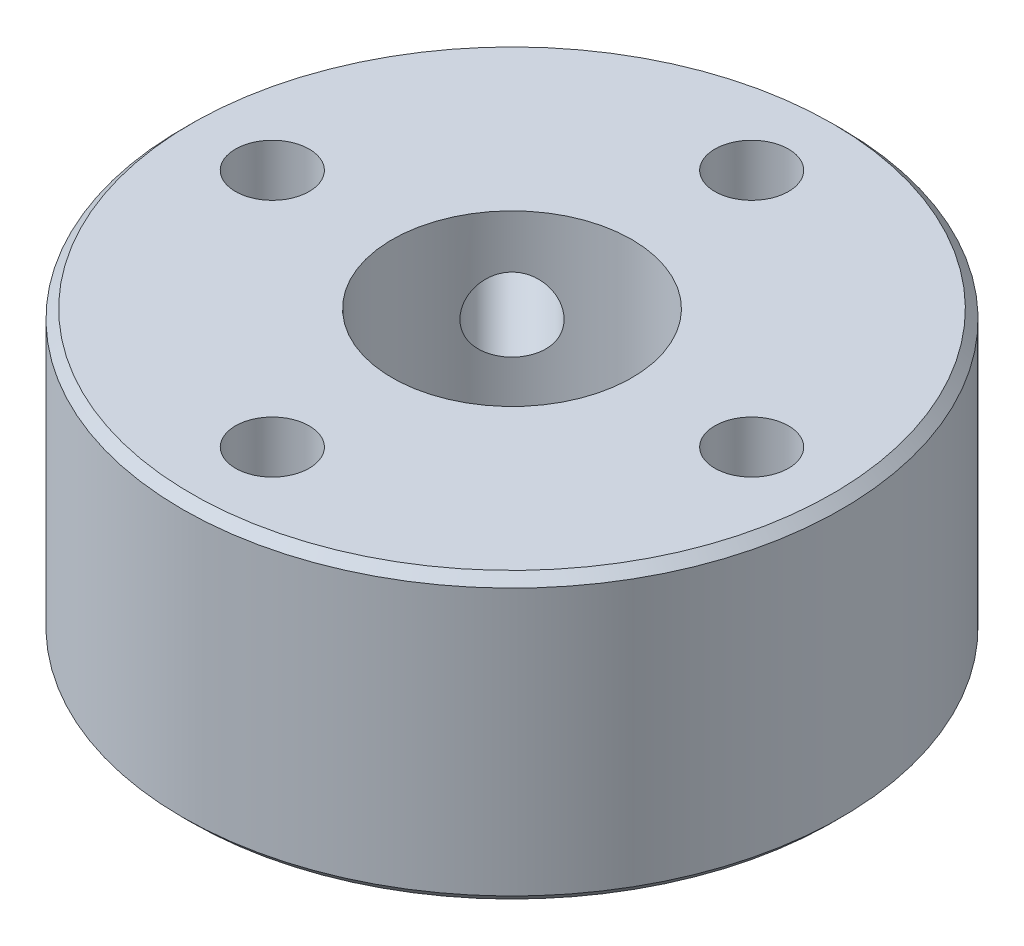
ISO-10303-21;
HEADER;
FILE_DESCRIPTION(('STEP AP214'),'2;1');
FILE_NAME('part.step','',(''),(''),'','','');
FILE_SCHEMA(('AUTOMOTIVE_DESIGN { 1 0 10303 214 1 1 1 1 }'));
ENDSEC;
DATA;
#1=APPLICATION_CONTEXT('core data for automotive mechanical design processes');
#2=APPLICATION_PROTOCOL_DEFINITION('international standard','automotive_design',2000,#1);
#3=PRODUCT_CONTEXT('',#1,'mechanical');
#4=PRODUCT('Part','Part','',(#3));
#5=PRODUCT_RELATED_PRODUCT_CATEGORY('part','',(#4));
#6=PRODUCT_DEFINITION_FORMATION('','',#4);
#7=PRODUCT_DEFINITION_CONTEXT('part definition',#1,'design');
#8=PRODUCT_DEFINITION('design','',#6,#7);
#9=PRODUCT_DEFINITION_SHAPE('','',#8);
#10=(LENGTH_UNIT() NAMED_UNIT(*) SI_UNIT(.MILLI.,.METRE.));
#11=(NAMED_UNIT(*) PLANE_ANGLE_UNIT() SI_UNIT($,.RADIAN.));
#12=(NAMED_UNIT(*) SI_UNIT($,.STERADIAN.) SOLID_ANGLE_UNIT());
#13=UNCERTAINTY_MEASURE_WITH_UNIT(LENGTH_MEASURE(1.E-05),#10,'distance_accuracy_value','');
#14=(GEOMETRIC_REPRESENTATION_CONTEXT(3) GLOBAL_UNCERTAINTY_ASSIGNED_CONTEXT((#13)) GLOBAL_UNIT_ASSIGNED_CONTEXT((#10,
#11,#12)) REPRESENTATION_CONTEXT('',''));
#15=CARTESIAN_POINT('',(0.,0.,0.));
#16=DIRECTION('',(0.,0.,1.));
#17=DIRECTION('',(1.,0.,0.));
#18=AXIS2_PLACEMENT_3D('',#15,#16,#17);
#19=CARTESIAN_POINT('',(11.,3.5,0.));
#20=DIRECTION('',(0.,-1.,0.));
#21=DIRECTION('',(0.,0.,1.));
#22=AXIS2_PLACEMENT_3D('',#19,#20,#21);
#23=PLANE('',#22);
#24=CARTESIAN_POINT('',(0.,3.5,0.));
#25=DIRECTION('',(0.,1.,0.));
#26=DIRECTION('',(0.,0.,1.));
#27=AXIS2_PLACEMENT_3D('',#24,#25,#26);
#28=CIRCLE('',#27,10.7);
#29=CARTESIAN_POINT('',(0.,3.5,10.7));
#30=VERTEX_POINT('',#29);
#31=EDGE_CURVE('E42',#30,#30,#28,.T.);
#32=ORIENTED_EDGE('',*,*,#31,.F.);
#33=EDGE_LOOP('',(#32));
#34=FACE_BOUND('',#33,.T.);
#35=CARTESIAN_POINT('',(0.,3.5,8.));
#36=DIRECTION('',(0.,1.,0.));
#37=DIRECTION('',(0.,0.,1.));
#38=AXIS2_PLACEMENT_3D('',#35,#36,#37);
#39=CIRCLE('',#38,1.22949999999999);
#40=CARTESIAN_POINT('',(0.,3.5,9.22949999999999));
#41=VERTEX_POINT('',#40);
#42=EDGE_CURVE('E143',#41,#41,#39,.T.);
#43=ORIENTED_EDGE('',*,*,#42,.T.);
#44=EDGE_LOOP('',(#43));
#45=FACE_BOUND('',#44,.T.);
#46=CARTESIAN_POINT('',(-8.,3.5,0.));
#47=DIRECTION('',(0.,1.,0.));
#48=DIRECTION('',(0.,0.,1.));
#49=AXIS2_PLACEMENT_3D('',#46,#47,#48);
#50=CIRCLE('',#49,1.22949999999999);
#51=CARTESIAN_POINT('',(-8.,3.5,1.22949999999998));
#52=VERTEX_POINT('',#51);
#53=EDGE_CURVE('E149',#52,#52,#50,.T.);
#54=ORIENTED_EDGE('',*,*,#53,.T.);
#55=EDGE_LOOP('',(#54));
#56=FACE_BOUND('',#55,.T.);
#57=CARTESIAN_POINT('',(0.,3.5,-8.));
#58=DIRECTION('',(0.,1.,0.));
#59=DIRECTION('',(0.,0.,1.));
#60=AXIS2_PLACEMENT_3D('',#57,#58,#59);
#61=CIRCLE('',#60,1.22949999999999);
#62=CARTESIAN_POINT('',(0.,3.5,-6.77050000000001));
#63=VERTEX_POINT('',#62);
#64=EDGE_CURVE('E155',#63,#63,#61,.T.);
#65=ORIENTED_EDGE('',*,*,#64,.T.);
#66=EDGE_LOOP('',(#65));
#67=FACE_BOUND('',#66,.T.);
#68=CARTESIAN_POINT('',(8.,3.5,0.));
#69=DIRECTION('',(0.,1.,0.));
#70=DIRECTION('',(0.,0.,1.));
#71=AXIS2_PLACEMENT_3D('',#68,#69,#70);
#72=CIRCLE('',#71,1.22949999999999);
#73=CARTESIAN_POINT('',(8.,3.5,1.22949999999998));
#74=VERTEX_POINT('',#73);
#75=EDGE_CURVE('E160',#74,#74,#72,.T.);
#76=ORIENTED_EDGE('',*,*,#75,.T.);
#77=EDGE_LOOP('',(#76));
#78=FACE_BOUND('',#77,.T.);
#79=CARTESIAN_POINT('',(0.,3.5,0.));
#80=DIRECTION('',(0.,1.,0.));
#81=DIRECTION('',(0.,0.,1.));
#82=AXIS2_PLACEMENT_3D('',#79,#80,#81);
#83=CIRCLE('',#82,4.75);
#84=CARTESIAN_POINT('',(0.,3.5,4.74999999999999));
#85=VERTEX_POINT('',#84);
#86=EDGE_CURVE('E68',#85,#85,#83,.T.);
#87=ORIENTED_EDGE('',*,*,#86,.T.);
#88=EDGE_LOOP('',(#87));
#89=FACE_BOUND('',#88,.T.);
#90=ADVANCED_FACE('F35',(#34,#45,#56,#67,#78,#89),#23,.T.);
#91=CARTESIAN_POINT('',(0.,3.5,0.));
#92=DIRECTION('',(0.,1.,0.));
#93=DIRECTION('',(0.,0.,-1.));
#94=AXIS2_PLACEMENT_3D('',#91,#92,#93);
#95=CYLINDRICAL_SURFACE('',#94,11.);
#96=CARTESIAN_POINT('',(0.,3.8,0.));
#97=DIRECTION('',(0.,1.,0.));
#98=DIRECTION('',(0.,0.,1.));
#99=AXIS2_PLACEMENT_3D('',#96,#97,#98);
#100=CIRCLE('',#99,11.);
#101=CARTESIAN_POINT('',(0.,3.8,11.));
#102=VERTEX_POINT('',#101);
#103=EDGE_CURVE('E46',#102,#102,#100,.F.);
#104=ORIENTED_EDGE('',*,*,#103,.F.);
#105=EDGE_LOOP('',(#104));
#106=FACE_BOUND('',#105,.T.);
#107=CARTESIAN_POINT('',(0.,12.7,0.));
#108=DIRECTION('',(0.,-1.,0.));
#109=DIRECTION('',(0.,0.,-1.));
#110=AXIS2_PLACEMENT_3D('',#107,#108,#109);
#111=CIRCLE('',#110,11.);
#112=CARTESIAN_POINT('',(0.,12.7,-11.));
#113=VERTEX_POINT('',#112);
#114=EDGE_CURVE('E50',#113,#113,#111,.F.);
#115=ORIENTED_EDGE('',*,*,#114,.F.);
#116=EDGE_LOOP('',(#115));
#117=FACE_BOUND('',#116,.T.);
#118=CARTESIAN_POINT('',(-8.59882275226415,10.,-6.86004717732644));
#119=CARTESIAN_POINT('',(-8.59882129286664,9.93117027355065,-6.8600499018174));
#120=CARTESIAN_POINT('',(-8.59518667033471,9.86229613969879,-6.86461255723123));
#121=CARTESIAN_POINT('',(-8.58070505990485,9.72646062815853,-6.88270511955675));
#122=CARTESIAN_POINT('',(-8.56985030621006,9.65950139105427,-6.89624468175966));
#123=CARTESIAN_POINT('',(-8.54113611433019,9.52948225375825,-6.93177555687223));
#124=CARTESIAN_POINT('',(-8.52328114749997,9.46641989416008,-6.95376147453005));
#125=CARTESIAN_POINT('',(-8.48090868866089,9.34593115210057,-7.00537632185254));
#126=CARTESIAN_POINT('',(-8.45639243790221,9.28850372234866,-7.035003827547));
#127=CARTESIAN_POINT('',(-8.40106000598523,9.18064350076,-7.10098913681331));
#128=CARTESIAN_POINT('',(-8.37021892433351,9.13023971994604,-7.13737348650389));
#129=CARTESIAN_POINT('',(-8.30292643558533,9.03810775599232,-7.2155434229723));
#130=CARTESIAN_POINT('',(-8.2664747621733,8.99637998489417,-7.25732926612544));
#131=CARTESIAN_POINT('',(-8.18865197844227,8.92268235973943,-7.34502684329077));
#132=CARTESIAN_POINT('',(-8.14726817514766,8.89073847238172,-7.39094914514193));
#133=CARTESIAN_POINT('',(-8.06063605791346,8.83768158482736,-7.48533534975694));
#134=CARTESIAN_POINT('',(-8.01538785998691,8.81656825961955,-7.53379917620481));
#135=CARTESIAN_POINT('',(-7.92237869391432,8.78585771157843,-7.63154280388263));
#136=CARTESIAN_POINT('',(-7.87462906785003,8.77621253169928,-7.6808183272306));
#137=CARTESIAN_POINT('',(-7.77774587505639,8.76856357150504,-7.77890866410947));
#138=CARTESIAN_POINT('',(-7.72861235250449,8.77055941999728,-7.82772349228065));
#139=CARTESIAN_POINT('',(-7.63060282385128,8.78609715402838,-7.92329264140649));
#140=CARTESIAN_POINT('',(-7.58172664713829,8.79958746827753,-7.97005518631401));
#141=CARTESIAN_POINT('',(-7.48548004971541,8.83765072971335,-8.06051817694851));
#142=CARTESIAN_POINT('',(-7.43810965268493,8.86222385109248,-8.10421857453416));
#143=CARTESIAN_POINT('',(-7.3462524680981,8.92181097404819,-8.18757803353648));
#144=CARTESIAN_POINT('',(-7.30177217789715,8.95684757301967,-8.22722809638135));
#145=CARTESIAN_POINT('',(-7.21724446292287,9.03635067096609,-8.30147892461426));
#146=CARTESIAN_POINT('',(-7.17719720081485,9.08081751579956,-8.33607950473163));
#147=CARTESIAN_POINT('',(-7.10266882414202,9.17820836854335,-8.39967343441055));
#148=CARTESIAN_POINT('',(-7.06821933196113,9.23117727652084,-8.42863509976386));
#149=CARTESIAN_POINT('',(-7.00635601568624,9.34391362832917,-8.48012975127206));
#150=CARTESIAN_POINT('',(-6.97894220644453,9.40368108651133,-8.50266272385603));
#151=CARTESIAN_POINT('',(-6.93213466591203,9.52835479035665,-8.54086802109923));
#152=CARTESIAN_POINT('',(-6.91274331916311,9.59326255706963,-8.55653830602106));
#153=CARTESIAN_POINT('',(-6.88271886669935,9.72635573816775,-8.58070835399781));
#154=CARTESIAN_POINT('',(-6.87208542582928,9.79454102702009,-8.58920839145036));
#155=CARTESIAN_POINT('',(-6.86001578135319,9.93185968774098,-8.59885131363562));
#156=CARTESIAN_POINT('',(-6.85853024334924,10.0009859555007,-8.60003366264347));
#157=CARTESIAN_POINT('',(-6.86468155524226,10.1385699773895,-8.59512431686715));
#158=CARTESIAN_POINT('',(-6.8723182504751,10.2070277428329,-8.58903274540964));
#159=CARTESIAN_POINT('',(-6.8963903859812,10.3411461960801,-8.56971611635838));
#160=CARTESIAN_POINT('',(-6.9128023906119,10.4068138333851,-8.55651005825033));
#161=CARTESIAN_POINT('',(-6.95380062021488,10.5337046001684,-8.52322415941052));
#162=CARTESIAN_POINT('',(-6.97838707725326,10.594927603407,-8.50314412353161));
#163=CARTESIAN_POINT('',(-7.03496857701433,10.711476469011,-8.45639193404135));
#164=CARTESIAN_POINT('',(-7.0669945967379,10.7667762209719,-8.42969218495235));
#165=CARTESIAN_POINT('',(-7.13727450203434,10.8696433254806,-8.37027029633066));
#166=CARTESIAN_POINT('',(-7.17552858060803,10.9172104383108,-8.33754797016072));
#167=CARTESIAN_POINT('',(-7.25715381142176,11.0034803333431,-8.26659846919221));
#168=CARTESIAN_POINT('',(-7.30054733997073,11.0421420210789,-8.22834704969394));
#169=CARTESIAN_POINT('',(-7.39087488219221,11.1092201293992,-8.14730906210454));
#170=CARTESIAN_POINT('',(-7.43780883699376,11.1376367202959,-8.10452256941878));
#171=CARTESIAN_POINT('',(-7.53360671484874,11.1833491434294,-8.0155492793842));
#172=CARTESIAN_POINT('',(-7.58246616180406,11.2006693192775,-7.96937017484399));
#173=CARTESIAN_POINT('',(-7.68070326147241,11.2237765974083,-7.87473469595186));
#174=CARTESIAN_POINT('',(-7.73008089566469,11.2295641104828,-7.82627840277602));
#175=CARTESIAN_POINT('',(-7.82762916245487,11.2294351646831,-7.72870979661974));
#176=CARTESIAN_POINT('',(-7.87580490581898,11.2235823074418,-7.67960249688663));
#177=CARTESIAN_POINT('',(-7.96989611416686,11.2004727246223,-7.58190985233426));
#178=CARTESIAN_POINT('',(-8.01581157870994,11.1832159968206,-7.53332450761676));
#179=CARTESIAN_POINT('',(-8.10418756106389,11.1378072227246,-7.43816933008204));
#180=CARTESIAN_POINT('',(-8.14664883688748,11.1096575747014,-7.39159905611854));
#181=CARTESIAN_POINT('',(-8.22711463283213,11.0432686601022,-7.30193250847853));
#182=CARTESIAN_POINT('',(-8.26511914355333,11.0050293722464,-7.2588362421292));
#183=CARTESIAN_POINT('',(-8.33601872521167,10.9193093469204,-7.17730664980136));
#184=CARTESIAN_POINT('',(-8.36888596969905,10.8717812190087,-7.13889894974694));
#185=CARTESIAN_POINT('',(-8.42859185980105,10.7689290627491,-7.0683083258122));
#186=CARTESIAN_POINT('',(-8.4554290659993,10.7136031781349,-7.03612688844268));
#187=CARTESIAN_POINT('',(-8.50260660126548,10.5965325750513,-6.97904440373246));
#188=CARTESIAN_POINT('',(-8.52292643825367,10.534768404314,-6.9541663402228));
#189=CARTESIAN_POINT('',(-8.55654499322926,10.4067511857121,-6.9127603432825));
#190=CARTESIAN_POINT('',(-8.56985150583789,10.340503213986,-6.89622314068824));
#191=CARTESIAN_POINT('',(-8.58594789644361,10.2282449508027,-6.87616155699825));
#192=CARTESIAN_POINT('',(-8.59077130839622,10.1829483447688,-6.87012920246373));
#193=CARTESIAN_POINT('',(-8.59720921390327,10.091774405567,-6.86207111546855));
#194=CARTESIAN_POINT('',(-8.59882372542038,10.0458970756512,-6.8600453605799));
#195=CARTESIAN_POINT('',(-8.59882275226415,10.,-6.86004717732644));
#196=B_SPLINE_CURVE_WITH_KNOTS('',3,(#118,#119,#120,#121,#122,#123,#124,#125,#126,#127,#128,
#129,#130,#131,#132,#133,#134,#135,#136,#137,#138,#139,#140,#141,#142,#143,#144,#145,#146,#147,
#148,#149,#150,#151,#152,#153,#154,#155,#156,#157,#158,#159,#160,#161,#162,#163,#164,#165,#166,
#167,#168,#169,#170,#171,#172,#173,#174,#175,#176,#177,#178,#179,#180,#181,#182,#183,#184,#185,
#186,#187,#188,#189,#190,#191,#192,#193,#194,#195),.UNSPECIFIED.,.T.,.F.,(4,2,2,2,2,2,2,2,2,2,2,
2,2,2,2,2,2,2,2,2,2,2,2,2,2,2,2,2,2,2,2,2,2,2,2,2,2,2,4),(0.,0.206321545013445,
0.412865364062192,0.619277468546969,0.825651136963587,1.03285344571688,1.24006559268876,
1.44782301394025,1.65557420029521,1.86245353056594,2.06932626419705,2.27527569668961,
2.48122836627608,2.68762907712022,2.89403735911312,3.10157391426357,3.30911090751898,
3.51670954340796,3.72430023436097,3.93077040670091,4.13723707846407,4.34315508735514,
4.54907894259134,4.75587610382279,4.96267967469486,5.17041924095308,5.3781553536347,
5.58543415443761,5.79270557186788,5.99884759351556,6.20498965535492,6.41108635713309,
6.61718349358666,6.82436093349382,7.03158777582831,7.23945994009084,7.44710058507751,
7.58468080015715,7.72226024509264),.UNSPECIFIED.);
#197=CARTESIAN_POINT('',(-8.59882275226415,10.,-6.86004717732644));
#198=VERTEX_POINT('',#197);
#199=EDGE_CURVE('E123',#198,#198,#196,.T.);
#200=ORIENTED_EDGE('',*,*,#199,.T.);
#201=EDGE_LOOP('',(#200));
#202=FACE_BOUND('',#201,.T.);
#203=ADVANCED_FACE('F112',(#106,#117,#202),#95,.T.);
#204=CARTESIAN_POINT('',(0.,13.,0.));
#205=DIRECTION('',(0.,1.,0.));
#206=DIRECTION('',(0.,0.,-1.));
#207=AXIS2_PLACEMENT_3D('',#204,#205,#206);
#208=PLANE('',#207);
#209=CARTESIAN_POINT('',(0.,13.,0.));
#210=DIRECTION('',(0.,-1.,0.));
#211=DIRECTION('',(0.,0.,-1.));
#212=AXIS2_PLACEMENT_3D('',#209,#210,#211);
#213=CIRCLE('',#212,10.7);
#214=CARTESIAN_POINT('',(0.,13.,-10.7));
#215=VERTEX_POINT('',#214);
#216=EDGE_CURVE('E10',#215,#215,#213,.T.);
#217=ORIENTED_EDGE('',*,*,#216,.F.);
#218=EDGE_LOOP('',(#217));
#219=FACE_BOUND('',#218,.T.);
#220=CARTESIAN_POINT('',(0.,13.,0.));
#221=DIRECTION('',(0.,-1.,0.));
#222=DIRECTION('',(0.,0.,-1.));
#223=AXIS2_PLACEMENT_3D('',#220,#221,#222);
#224=CIRCLE('',#223,3.99999999999999);
#225=CARTESIAN_POINT('',(0.,13.,-4.));
#226=VERTEX_POINT('',#225);
#227=EDGE_CURVE('E128',#226,#226,#224,.T.);
#228=ORIENTED_EDGE('',*,*,#227,.T.);
#229=EDGE_LOOP('',(#228));
#230=FACE_BOUND('',#229,.T.);
#231=CARTESIAN_POINT('',(0.,13.,8.));
#232=DIRECTION('',(0.,-1.,0.));
#233=DIRECTION('',(0.,0.,-1.));
#234=AXIS2_PLACEMENT_3D('',#231,#232,#233);
#235=CIRCLE('',#234,1.22949999999999);
#236=CARTESIAN_POINT('',(0.,13.,6.77050000000001));
#237=VERTEX_POINT('',#236);
#238=EDGE_CURVE('E140',#237,#237,#235,.T.);
#239=ORIENTED_EDGE('',*,*,#238,.T.);
#240=EDGE_LOOP('',(#239));
#241=FACE_BOUND('',#240,.T.);
#242=CARTESIAN_POINT('',(-8.,13.,0.));
#243=DIRECTION('',(0.,-1.,0.));
#244=DIRECTION('',(0.,0.,-1.));
#245=AXIS2_PLACEMENT_3D('',#242,#243,#244);
#246=CIRCLE('',#245,1.22949999999999);
#247=CARTESIAN_POINT('',(-8.,13.,-1.22949999999999));
#248=VERTEX_POINT('',#247);
#249=EDGE_CURVE('E146',#248,#248,#246,.T.);
#250=ORIENTED_EDGE('',*,*,#249,.T.);
#251=EDGE_LOOP('',(#250));
#252=FACE_BOUND('',#251,.T.);
#253=CARTESIAN_POINT('',(0.,13.,-8.));
#254=DIRECTION('',(0.,-1.,0.));
#255=DIRECTION('',(0.,0.,-1.));
#256=AXIS2_PLACEMENT_3D('',#253,#254,#255);
#257=CIRCLE('',#256,1.22949999999999);
#258=CARTESIAN_POINT('',(0.,13.,-9.22949999999999));
#259=VERTEX_POINT('',#258);
#260=EDGE_CURVE('E152',#259,#259,#257,.T.);
#261=ORIENTED_EDGE('',*,*,#260,.T.);
#262=EDGE_LOOP('',(#261));
#263=FACE_BOUND('',#262,.T.);
#264=CARTESIAN_POINT('',(8.,13.,0.));
#265=DIRECTION('',(0.,-1.,0.));
#266=DIRECTION('',(0.,0.,-1.));
#267=AXIS2_PLACEMENT_3D('',#264,#265,#266);
#268=CIRCLE('',#267,1.22949999999999);
#269=CARTESIAN_POINT('',(8.,13.,-1.22949999999999));
#270=VERTEX_POINT('',#269);
#271=EDGE_CURVE('E158',#270,#270,#268,.T.);
#272=ORIENTED_EDGE('',*,*,#271,.T.);
#273=EDGE_LOOP('',(#272));
#274=FACE_BOUND('',#273,.T.);
#275=ADVANCED_FACE('F108',(#219,#230,#241,#252,#263,#274),#208,.T.);
#276=CARTESIAN_POINT('',(0.,0.,0.));
#277=DIRECTION('',(0.,1.,0.));
#278=DIRECTION('',(0.,0.,-1.));
#279=AXIS2_PLACEMENT_3D('',#276,#277,#278);
#280=CYLINDRICAL_SURFACE('',#279,4.75);
#281=CARTESIAN_POINT('',(0.,0.299999999999999,0.));
#282=DIRECTION('',(0.,1.,0.));
#283=DIRECTION('',(0.,0.,1.));
#284=AXIS2_PLACEMENT_3D('',#281,#282,#283);
#285=CIRCLE('',#284,4.75);
#286=CARTESIAN_POINT('',(0.,0.299999999999999,4.74999999999999));
#287=VERTEX_POINT('',#286);
#288=EDGE_CURVE('E55',#287,#287,#285,.F.);
#289=ORIENTED_EDGE('',*,*,#288,.F.);
#290=EDGE_LOOP('',(#289));
#291=FACE_BOUND('',#290,.T.);
#292=ORIENTED_EDGE('',*,*,#86,.F.);
#293=EDGE_LOOP('',(#292));
#294=FACE_BOUND('',#293,.T.);
#295=ADVANCED_FACE('F104',(#291,#294),#280,.T.);
#296=CARTESIAN_POINT('',(0.,0.,0.));
#297=DIRECTION('',(0.,-1.,0.));
#298=DIRECTION('',(0.,0.,1.));
#299=AXIS2_PLACEMENT_3D('',#296,#297,#298);
#300=PLANE('',#299);
#301=CARTESIAN_POINT('',(0.,0.,0.));
#302=DIRECTION('',(0.,1.,0.));
#303=DIRECTION('',(0.,0.,1.));
#304=AXIS2_PLACEMENT_3D('',#301,#302,#303);
#305=CIRCLE('',#304,4.45);
#306=CARTESIAN_POINT('',(0.,0.,4.44999999999999));
#307=VERTEX_POINT('',#306);
#308=EDGE_CURVE('E58',#307,#307,#305,.T.);
#309=ORIENTED_EDGE('',*,*,#308,.F.);
#310=EDGE_LOOP('',(#309));
#311=FACE_BOUND('',#310,.T.);
#312=CARTESIAN_POINT('',(0.,0.,0.));
#313=DIRECTION('',(0.,-1.,0.));
#314=DIRECTION('',(0.,0.,-1.));
#315=AXIS2_PLACEMENT_3D('',#312,#313,#314);
#316=CIRCLE('',#315,2.00000000000001);
#317=CARTESIAN_POINT('',(0.,0.,-2.00000000000002));
#318=VERTEX_POINT('',#317);
#319=EDGE_CURVE('E137',#318,#318,#316,.T.);
#320=ORIENTED_EDGE('',*,*,#319,.F.);
#321=EDGE_LOOP('',(#320));
#322=FACE_BOUND('',#321,.T.);
#323=ADVANCED_FACE('F100',(#311,#322),#300,.T.);
#324=CARTESIAN_POINT('',(8.,13.,0.));
#325=DIRECTION('',(0.,1.,0.));
#326=DIRECTION('',(0.,0.,-1.));
#327=AXIS2_PLACEMENT_3D('',#324,#325,#326);
#328=CYLINDRICAL_SURFACE('',#327,1.22949999999999);
#329=ORIENTED_EDGE('',*,*,#75,.F.);
#330=EDGE_LOOP('',(#329));
#331=FACE_BOUND('',#330,.T.);
#332=ORIENTED_EDGE('',*,*,#271,.F.);
#333=EDGE_LOOP('',(#332));
#334=FACE_BOUND('',#333,.T.);
#335=ADVANCED_FACE('F96',(#331,#334),#328,.F.);
#336=CARTESIAN_POINT('',(0.,13.,-8.));
#337=DIRECTION('',(0.,1.,0.));
#338=DIRECTION('',(0.,0.,-1.));
#339=AXIS2_PLACEMENT_3D('',#336,#337,#338);
#340=CYLINDRICAL_SURFACE('',#339,1.22949999999999);
#341=ORIENTED_EDGE('',*,*,#64,.F.);
#342=EDGE_LOOP('',(#341));
#343=FACE_BOUND('',#342,.T.);
#344=ORIENTED_EDGE('',*,*,#260,.F.);
#345=EDGE_LOOP('',(#344));
#346=FACE_BOUND('',#345,.T.);
#347=ADVANCED_FACE('F92',(#343,#346),#340,.F.);
#348=CARTESIAN_POINT('',(-8.,13.,0.));
#349=DIRECTION('',(0.,1.,0.));
#350=DIRECTION('',(0.,0.,-1.));
#351=AXIS2_PLACEMENT_3D('',#348,#349,#350);
#352=CYLINDRICAL_SURFACE('',#351,1.22949999999999);
#353=ORIENTED_EDGE('',*,*,#53,.F.);
#354=EDGE_LOOP('',(#353));
#355=FACE_BOUND('',#354,.T.);
#356=ORIENTED_EDGE('',*,*,#249,.F.);
#357=EDGE_LOOP('',(#356));
#358=FACE_BOUND('',#357,.T.);
#359=ADVANCED_FACE('F88',(#355,#358),#352,.F.);
#360=CARTESIAN_POINT('',(0.,13.,8.));
#361=DIRECTION('',(0.,1.,0.));
#362=DIRECTION('',(0.,0.,-1.));
#363=AXIS2_PLACEMENT_3D('',#360,#361,#362);
#364=CYLINDRICAL_SURFACE('',#363,1.22949999999999);
#365=ORIENTED_EDGE('',*,*,#42,.F.);
#366=EDGE_LOOP('',(#365));
#367=FACE_BOUND('',#366,.T.);
#368=ORIENTED_EDGE('',*,*,#238,.F.);
#369=EDGE_LOOP('',(#368));
#370=FACE_BOUND('',#369,.T.);
#371=ADVANCED_FACE('F84',(#367,#370),#364,.F.);
#372=CARTESIAN_POINT('',(0.,13.,0.));
#373=DIRECTION('',(0.,1.,0.));
#374=DIRECTION('',(0.,0.,-1.));
#375=AXIS2_PLACEMENT_3D('',#372,#373,#374);
#376=CYLINDRICAL_SURFACE('',#375,2.00000000000001);
#377=ORIENTED_EDGE('',*,*,#319,.T.);
#378=EDGE_LOOP('',(#377));
#379=FACE_BOUND('',#378,.T.);
#380=CARTESIAN_POINT('',(0.,4.5,0.));
#381=DIRECTION('',(0.,-1.,0.));
#382=DIRECTION('',(0.,0.,-1.));
#383=AXIS2_PLACEMENT_3D('',#380,#381,#382);
#384=CIRCLE('',#383,2.00000000000001);
#385=CARTESIAN_POINT('',(0.,4.5,-2.00000000000002));
#386=VERTEX_POINT('',#385);
#387=EDGE_CURVE('E134',#386,#386,#384,.T.);
#388=ORIENTED_EDGE('',*,*,#387,.F.);
#389=EDGE_LOOP('',(#388));
#390=FACE_BOUND('',#389,.T.);
#391=ADVANCED_FACE('F80',(#379,#390),#376,.F.);
#392=CARTESIAN_POINT('',(2.00000000000001,4.5,0.));
#393=DIRECTION('',(0.,-1.,0.));
#394=DIRECTION('',(0.,0.,1.));
#395=AXIS2_PLACEMENT_3D('',#392,#393,#394);
#396=PLANE('',#395);
#397=ORIENTED_EDGE('',*,*,#387,.T.);
#398=EDGE_LOOP('',(#397));
#399=FACE_BOUND('',#398,.T.);
#400=CARTESIAN_POINT('',(0.,4.5,0.));
#401=DIRECTION('',(0.,-1.,0.));
#402=DIRECTION('',(0.,0.,-1.));
#403=AXIS2_PLACEMENT_3D('',#400,#401,#402);
#404=CIRCLE('',#403,3.99999999999999);
#405=CARTESIAN_POINT('',(0.,4.5,-4.));
#406=VERTEX_POINT('',#405);
#407=EDGE_CURVE('E131',#406,#406,#404,.T.);
#408=ORIENTED_EDGE('',*,*,#407,.F.);
#409=EDGE_LOOP('',(#408));
#410=FACE_BOUND('',#409,.T.);
#411=ADVANCED_FACE('F76',(#399,#410),#396,.F.);
#412=CARTESIAN_POINT('',(0.,13.,0.));
#413=DIRECTION('',(0.,1.,0.));
#414=DIRECTION('',(0.,0.,-1.));
#415=AXIS2_PLACEMENT_3D('',#412,#413,#414);
#416=CYLINDRICAL_SURFACE('',#415,3.99999999999999);
#417=CARTESIAN_POINT('',(-3.56088641741461,10.,-1.82211084247697));
#418=CARTESIAN_POINT('',(-3.56088636044018,9.93271323239236,-1.82211166057228));
#419=CARTESIAN_POINT('',(-3.55824279191973,9.86542031464729,-1.82730530468804));
#420=CARTESIAN_POINT('',(-3.54765563516587,9.73280747245185,-1.84777395183811));
#421=CARTESIAN_POINT('',(-3.53971047582309,9.66748813886653,-1.86305194332177));
#422=CARTESIAN_POINT('',(-3.51850120608781,9.54076205874594,-1.90280093089096));
#423=CARTESIAN_POINT('',(-3.50524627054824,9.47934877390323,-1.92725606505075));
#424=CARTESIAN_POINT('',(-3.47335860076753,9.36185116370561,-1.98414701435012));
#425=CARTESIAN_POINT('',(-3.45472497570161,9.30576772313258,-2.01658415134688));
#426=CARTESIAN_POINT('',(-3.41137574632521,9.19865819722333,-2.08910241543031));
#427=CARTESIAN_POINT('',(-3.38649385425278,9.147835324643,-2.12938435577803));
#428=CARTESIAN_POINT('',(-3.33095125416187,9.05450275612301,-2.21525961290904));
#429=CARTESIAN_POINT('',(-3.30028976733767,9.01199418211756,-2.26085364518504));
#430=CARTESIAN_POINT('',(-3.23259764283245,8.93560607734146,-2.35665471377096));
#431=CARTESIAN_POINT('',(-3.19544268081067,8.90193496235179,-2.40694067071496));
#432=CARTESIAN_POINT('',(-3.11569403434941,8.84554820014902,-2.50931332668817));
#433=CARTESIAN_POINT('',(-3.0731015871935,8.82283006621762,-2.56139961409735));
#434=CARTESIAN_POINT('',(-2.98466876958245,8.78967016798867,-2.66386809179658));
#435=CARTESIAN_POINT('',(-2.93896379284495,8.77888126864208,-2.71425461952537));
#436=CARTESIAN_POINT('',(-2.84440930331211,8.76878714934073,-2.81318562279717));
#437=CARTESIAN_POINT('',(-2.79556048513687,8.76947940128593,-2.86173050150376));
#438=CARTESIAN_POINT('',(-2.69789199908769,8.78209764755673,-2.95393667265013));
#439=CARTESIAN_POINT('',(-2.64912589934441,8.79364749538074,-2.99770694646493));
#440=CARTESIAN_POINT('',(-2.5516088828605,8.82703702811001,-3.08113815157546));
#441=CARTESIAN_POINT('',(-2.50285796730161,8.84887737645401,-3.12079881771956));
#442=CARTESIAN_POINT('',(-2.40640504246629,8.90247499172924,-3.19577757446895));
#443=CARTESIAN_POINT('',(-2.35872264121792,8.93434812099455,-3.23103784059611));
#444=CARTESIAN_POINT('',(-2.26665411695412,9.00701413463461,-3.29628089283317));
#445=CARTESIAN_POINT('',(-2.22226881009435,9.04780921773894,-3.32626237474419));
#446=CARTESIAN_POINT('',(-2.13668846579986,9.13910047339346,-3.38190397522514));
#447=CARTESIAN_POINT('',(-2.09569463446282,9.18992186795826,-3.40734070025252));
#448=CARTESIAN_POINT('',(-2.0207064340188,9.2988253917779,-3.45234167175166));
#449=CARTESIAN_POINT('',(-1.98671283455157,9.35690831827407,-3.47190527261155));
#450=CARTESIAN_POINT('',(-1.92701109845606,9.47951041315459,-3.50539830494747));
#451=CARTESIAN_POINT('',(-1.90139376378875,9.54409079136133,-3.51926638259997));
#452=CARTESIAN_POINT('',(-1.86035872257254,9.67735267159558,-3.54113149887052));
#453=CARTESIAN_POINT('',(-1.84493749231934,9.74603274783954,-3.54913056588367));
#454=CARTESIAN_POINT('',(-1.82561672038283,9.88267579503358,-3.55910633887849));
#455=CARTESIAN_POINT('',(-1.82129153028986,9.95056237935887,-3.56130562388302));
#456=CARTESIAN_POINT('',(-1.82318645087371,10.086143202587,-3.56033605796613));
#457=CARTESIAN_POINT('',(-1.82940499648719,10.1538374685427,-3.55716800374775));
#458=CARTESIAN_POINT('',(-1.85169305994496,10.2851643256409,-3.54561437294675));
#459=CARTESIAN_POINT('',(-1.86748510050071,10.3488574789518,-3.53737566470496));
#460=CARTESIAN_POINT('',(-1.90783716400721,10.4724827344969,-3.51577553199073));
#461=CARTESIAN_POINT('',(-1.93239858586756,10.53241423487,-3.50241329017662));
#462=CARTESIAN_POINT('',(-1.98991926897622,10.6486664712185,-3.4700628295757));
#463=CARTESIAN_POINT('',(-2.02309388570291,10.7048396427184,-3.4509279260636));
#464=CARTESIAN_POINT('',(-2.0960225432001,10.8103489424882,-3.4071242641586));
#465=CARTESIAN_POINT('',(-2.13577823732119,10.8596833469315,-3.38245411460225));
#466=CARTESIAN_POINT('',(-2.22199843231044,10.9521442502638,-3.32647919373079));
#467=CARTESIAN_POINT('',(-2.26866731976413,10.9949445224406,-3.29494898054064));
#468=CARTESIAN_POINT('',(-2.36559326149792,11.0706694310964,-3.22606542413734));
#469=CARTESIAN_POINT('',(-2.41585014491811,11.1035945374417,-3.18871235810759));
#470=CARTESIAN_POINT('',(-2.51766488602866,11.158317372035,-3.10894035881918));
#471=CARTESIAN_POINT('',(-2.5692101220145,11.1801968972725,-3.06656162317438));
#472=CARTESIAN_POINT('',(-2.67206292344338,11.2124071440254,-2.97736564871453));
#473=CARTESIAN_POINT('',(-2.72337055594718,11.2227413504674,-2.93054975387654));
#474=CARTESIAN_POINT('',(-2.82193039803925,11.2312919563112,-2.83570076161695));
#475=CARTESIAN_POINT('',(-2.86926270993315,11.2299803366133,-2.78779293514954));
#476=CARTESIAN_POINT('',(-2.96070314443789,11.2164124791111,-2.69048217085116));
#477=CARTESIAN_POINT('',(-3.0048114655498,11.2041569157404,-2.64107932533375));
#478=CARTESIAN_POINT('',(-3.08826701267712,11.1693461925415,-2.54297267364229));
#479=CARTESIAN_POINT('',(-3.12766412535923,11.1469138402577,-2.49426747859603));
#480=CARTESIAN_POINT('',(-3.20164316502022,11.0924967521972,-2.3985710866993));
#481=CARTESIAN_POINT('',(-3.23622427819202,11.0605104048521,-2.35158018051691));
#482=CARTESIAN_POINT('',(-3.30127706387479,10.9866660981631,-2.25939366080646));
#483=CARTESIAN_POINT('',(-3.33157458054523,10.9445161350955,-2.21430914377304));
#484=CARTESIAN_POINT('',(-3.38651586865366,10.8520605595793,-2.12933687304591));
#485=CARTESIAN_POINT('',(-3.41115796971961,10.8017525450536,-2.08945065621086));
#486=CARTESIAN_POINT('',(-3.45548075500827,10.6924939317204,-2.01533614548439));
#487=CARTESIAN_POINT('',(-3.47497913151384,10.6333196929467,-1.98132762559641));
#488=CARTESIAN_POINT('',(-3.50801460339819,10.5091478000506,-1.92223465813026));
#489=CARTESIAN_POINT('',(-3.52155430096675,10.4441527028851,-1.8971463159799));
#490=CARTESIAN_POINT('',(-3.54174435321202,10.3165159659032,-1.85915725330068));
#491=CARTESIAN_POINT('',(-3.54892539249878,10.2542336202343,-1.84532789411869));
#492=CARTESIAN_POINT('',(-3.55849590908534,10.1279691114302,-1.82680533430844));
#493=CARTESIAN_POINT('',(-3.56088647159528,10.0639873366035,-1.82211006449726));
#494=CARTESIAN_POINT('',(-3.56088641741461,10.,-1.82211084247697));
#495=B_SPLINE_CURVE_WITH_KNOTS('',3,(#417,#418,#419,#420,#421,#422,#423,#424,#425,#426,#427,
#428,#429,#430,#431,#432,#433,#434,#435,#436,#437,#438,#439,#440,#441,#442,#443,#444,#445,#446,
#447,#448,#449,#450,#451,#452,#453,#454,#455,#456,#457,#458,#459,#460,#461,#462,#463,#464,#465,
#466,#467,#468,#469,#470,#471,#472,#473,#474,#475,#476,#477,#478,#479,#480,#481,#482,#483,#484,
#485,#486,#487,#488,#489,#490,#491,#492,#493,#494),.UNSPECIFIED.,.T.,.F.,(4,2,2,2,2,2,2,2,2,2,2,
2,2,2,2,2,2,2,2,2,2,2,2,2,2,2,2,2,2,2,2,2,2,2,2,2,2,2,4),(0.,0.201624072764263,
0.403307922725165,0.604644772641534,0.806014987351853,1.01345060448725,1.22091419377153,
1.43290248547724,1.64484262557059,1.85043834262084,2.05598878898113,2.25467080257228,
2.45336562714238,2.65444488101846,2.85557374489114,3.06482451305133,3.27409827499637,
3.48557073241775,3.69697006814365,3.90012978234346,4.10325934309522,4.30076552374326,
4.49830322506707,4.70135713713476,4.90446213965653,5.11567083988867,5.32686948908872,
5.53648030118361,5.74602782565067,5.94712284217632,6.14820546683672,6.34692356161485,
6.54567519511713,6.75101314533283,6.95641166591897,7.16832976260415,7.38015522136549,
7.57193603470332,7.76367339808163),.UNSPECIFIED.);
#496=CARTESIAN_POINT('',(-3.56088641741461,10.,-1.82211084247697));
#497=VERTEX_POINT('',#496);
#498=EDGE_CURVE('E61',#497,#497,#495,.T.);
#499=ORIENTED_EDGE('',*,*,#498,.F.);
#500=EDGE_LOOP('',(#499));
#501=FACE_BOUND('',#500,.T.);
#502=ORIENTED_EDGE('',*,*,#407,.T.);
#503=EDGE_LOOP('',(#502));
#504=FACE_BOUND('',#503,.T.);
#505=ORIENTED_EDGE('',*,*,#227,.F.);
#506=EDGE_LOOP('',(#505));
#507=FACE_BOUND('',#506,.T.);
#508=ADVANCED_FACE('F72',(#501,#504,#507),#416,.F.);
#509=CARTESIAN_POINT('',(-2.69149862994579,10.,-2.69149862994579));
#510=DIRECTION('',(0.707106781186548,0.,0.707106781186547));
#511=DIRECTION('',(-0.707106781186547,0.,0.707106781186548));
#512=AXIS2_PLACEMENT_3D('',#509,#510,#511);
#513=CYLINDRICAL_SURFACE('',#512,1.22949999999999);
#514=ORIENTED_EDGE('',*,*,#199,.F.);
#515=EDGE_LOOP('',(#514));
#516=FACE_BOUND('',#515,.T.);
#517=ORIENTED_EDGE('',*,*,#498,.T.);
#518=EDGE_LOOP('',(#517));
#519=FACE_BOUND('',#518,.T.);
#520=ADVANCED_FACE('F70',(#516,#519),#513,.F.);
#521=CARTESIAN_POINT('',(0.,0.,0.));
#522=DIRECTION('',(0.,1.,0.));
#523=DIRECTION('',(0.,0.,-1.));
#524=AXIS2_PLACEMENT_3D('',#521,#522,#523);
#525=CONICAL_SURFACE('',#524,4.45,0.78539816339745);
#526=ORIENTED_EDGE('',*,*,#288,.T.);
#527=EDGE_LOOP('',(#526));
#528=FACE_BOUND('',#527,.T.);
#529=ORIENTED_EDGE('',*,*,#308,.T.);
#530=EDGE_LOOP('',(#529));
#531=FACE_BOUND('',#530,.T.);
#532=ADVANCED_FACE('F121',(#528,#531),#525,.T.);
#533=CARTESIAN_POINT('',(0.,3.8,0.));
#534=DIRECTION('',(0.,1.,0.));
#535=DIRECTION('',(0.,0.,-1.));
#536=AXIS2_PLACEMENT_3D('',#533,#534,#535);
#537=CONICAL_SURFACE('',#536,11.,0.785398163397448);
#538=ORIENTED_EDGE('',*,*,#31,.T.);
#539=EDGE_LOOP('',(#538));
#540=FACE_BOUND('',#539,.T.);
#541=ORIENTED_EDGE('',*,*,#103,.T.);
#542=EDGE_LOOP('',(#541));
#543=FACE_BOUND('',#542,.T.);
#544=ADVANCED_FACE('F205',(#540,#543),#537,.T.);
#545=CARTESIAN_POINT('',(0.,13.,0.));
#546=DIRECTION('',(0.,-1.,0.));
#547=DIRECTION('',(0.,0.,1.));
#548=AXIS2_PLACEMENT_3D('',#545,#546,#547);
#549=CONICAL_SURFACE('',#548,10.7,0.785398163397437);
#550=ORIENTED_EDGE('',*,*,#114,.T.);
#551=EDGE_LOOP('',(#550));
#552=FACE_BOUND('',#551,.T.);
#553=ORIENTED_EDGE('',*,*,#216,.T.);
#554=EDGE_LOOP('',(#553));
#555=FACE_BOUND('',#554,.T.);
#556=ADVANCED_FACE('F37',(#552,#555),#549,.T.);
#557=CLOSED_SHELL('',(#90,#203,#275,#295,#323,#335,#347,#359,#371,#391,#411,#508,#520,#532,#544,#556));
#558=MANIFOLD_SOLID_BREP('B2',#557);
#559=ADVANCED_BREP_SHAPE_REPRESENTATION('',(#18,#558),#14);
#560=SHAPE_DEFINITION_REPRESENTATION(#9,#559);
ENDSEC;
END-ISO-10303-21;
